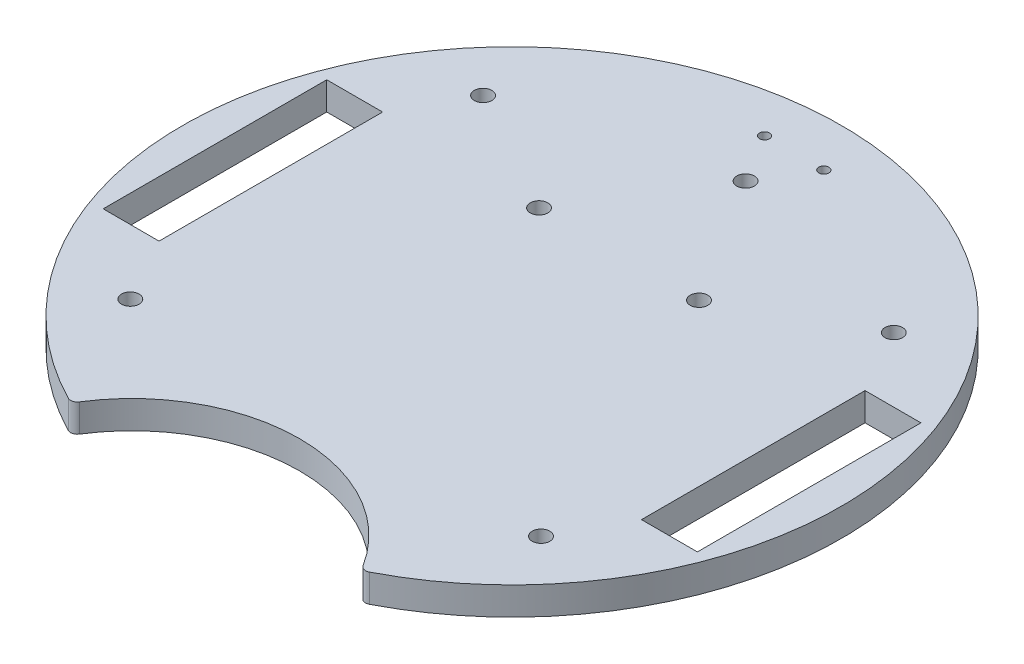
ISO-10303-21;
HEADER;
FILE_DESCRIPTION(('STEP AP214'),'2;1');
FILE_NAME('part.step','',(''),(''),'','','');
FILE_SCHEMA(('AUTOMOTIVE_DESIGN { 1 0 10303 214 1 1 1 1 }'));
ENDSEC;
DATA;
#1=APPLICATION_CONTEXT('core data for automotive mechanical design processes');
#2=APPLICATION_PROTOCOL_DEFINITION('international standard','automotive_design',2000,#1);
#3=PRODUCT_CONTEXT('',#1,'mechanical');
#4=PRODUCT('Part','Part','',(#3));
#5=PRODUCT_RELATED_PRODUCT_CATEGORY('part','',(#4));
#6=PRODUCT_DEFINITION_FORMATION('','',#4);
#7=PRODUCT_DEFINITION_CONTEXT('part definition',#1,'design');
#8=PRODUCT_DEFINITION('design','',#6,#7);
#9=PRODUCT_DEFINITION_SHAPE('','',#8);
#10=(LENGTH_UNIT() NAMED_UNIT(*) SI_UNIT(.MILLI.,.METRE.));
#11=(NAMED_UNIT(*) PLANE_ANGLE_UNIT() SI_UNIT($,.RADIAN.));
#12=(NAMED_UNIT(*) SI_UNIT($,.STERADIAN.) SOLID_ANGLE_UNIT());
#13=UNCERTAINTY_MEASURE_WITH_UNIT(LENGTH_MEASURE(1.E-05),#10,'distance_accuracy_value','');
#14=(GEOMETRIC_REPRESENTATION_CONTEXT(3) GLOBAL_UNCERTAINTY_ASSIGNED_CONTEXT((#13)) GLOBAL_UNIT_ASSIGNED_CONTEXT((#10,
#11,#12)) REPRESENTATION_CONTEXT('',''));
#15=CARTESIAN_POINT('',(0.,0.,0.));
#16=DIRECTION('',(0.,0.,1.));
#17=DIRECTION('',(1.,0.,0.));
#18=AXIS2_PLACEMENT_3D('',#15,#16,#17);
#19=CARTESIAN_POINT('',(33.5100001196225,6.35,65.3012960955778));
#20=DIRECTION('',(0.,-1.,0.));
#21=DIRECTION('',(0.,0.,-1.));
#22=AXIS2_PLACEMENT_3D('',#19,#20,#21);
#23=CYLINDRICAL_SURFACE('',#22,1.50000000000011);
#24=CARTESIAN_POINT('',(33.5100001196225,0.,65.3012960955778));
#25=DIRECTION('',(0.,1.,0.));
#26=DIRECTION('',(0.,0.,1.));
#27=AXIS2_PLACEMENT_3D('',#24,#25,#26);
#28=CIRCLE('',#27,1.50000000000011);
#29=CARTESIAN_POINT('',(34.1948335778492,0.,66.6358383895849));
#30=VERTEX_POINT('',#29);
#31=CARTESIAN_POINT('',(32.2406819332729,0.,66.100565350462));
#32=VERTEX_POINT('',#31);
#33=EDGE_CURVE('E220',#30,#32,#28,.F.);
#34=ORIENTED_EDGE('',*,*,#33,.F.);
#35=DIRECTION('',(0.,-1.,0.));
#36=VECTOR('',#35,1.);
#37=CARTESIAN_POINT('',(34.1948335778492,6.35,66.6358383895849));
#38=LINE('',#37,#36);
#39=CARTESIAN_POINT('',(34.1948335778492,6.35,66.6358383895849));
#40=VERTEX_POINT('',#39);
#41=EDGE_CURVE('E11',#40,#30,#38,.T.);
#42=ORIENTED_EDGE('',*,*,#41,.F.);
#43=CARTESIAN_POINT('',(33.5100001196225,6.35,65.3012960955778));
#44=DIRECTION('',(0.,1.,0.));
#45=DIRECTION('',(0.,0.,1.));
#46=AXIS2_PLACEMENT_3D('',#43,#44,#45);
#47=CIRCLE('',#46,1.50000000000011);
#48=CARTESIAN_POINT('',(32.2406819332729,6.35,66.100565350462));
#49=VERTEX_POINT('',#48);
#50=EDGE_CURVE('E145',#40,#49,#47,.F.);
#51=ORIENTED_EDGE('',*,*,#50,.T.);
#52=DIRECTION('',(0.,-1.,0.));
#53=VECTOR('',#52,1.);
#54=CARTESIAN_POINT('',(32.2406819332729,6.35,66.100565350462));
#55=LINE('',#54,#53);
#56=EDGE_CURVE('E53',#49,#32,#55,.T.);
#57=ORIENTED_EDGE('',*,*,#56,.T.);
#58=EDGE_LOOP('',(#34,#42,#51,#57));
#59=FACE_BOUND('',#58,.T.);
#60=ADVANCED_FACE('F34',(#59),#23,.T.);
#61=CARTESIAN_POINT('',(0.,6.35,0.));
#62=DIRECTION('',(0.,-1.,0.));
#63=DIRECTION('',(0.,0.,-1.));
#64=AXIS2_PLACEMENT_3D('',#61,#62,#63);
#65=CYLINDRICAL_SURFACE('',#64,74.8974071734108);
#66=CARTESIAN_POINT('',(0.,0.,0.));
#67=DIRECTION('',(0.,1.,0.));
#68=DIRECTION('',(0.,0.,1.));
#69=AXIS2_PLACEMENT_3D('',#66,#67,#68);
#70=CIRCLE('',#69,74.8974071734108);
#71=CARTESIAN_POINT('',(-34.1948335778492,0.,66.6358383895849));
#72=VERTEX_POINT('',#71);
#73=EDGE_CURVE('E150',#30,#72,#70,.T.);
#74=ORIENTED_EDGE('',*,*,#73,.T.);
#75=DIRECTION('',(0.,-1.,0.));
#76=VECTOR('',#75,1.);
#77=CARTESIAN_POINT('',(-34.1948335778492,6.35,66.6358383895849));
#78=LINE('',#77,#76);
#79=CARTESIAN_POINT('',(-34.1948335778492,6.35,66.6358383895849));
#80=VERTEX_POINT('',#79);
#81=EDGE_CURVE('E44',#80,#72,#78,.T.);
#82=ORIENTED_EDGE('',*,*,#81,.F.);
#83=CARTESIAN_POINT('',(0.,6.35,0.));
#84=DIRECTION('',(0.,1.,0.));
#85=DIRECTION('',(0.,0.,1.));
#86=AXIS2_PLACEMENT_3D('',#83,#84,#85);
#87=CIRCLE('',#86,74.8974071734108);
#88=EDGE_CURVE('E139',#40,#80,#87,.T.);
#89=ORIENTED_EDGE('',*,*,#88,.F.);
#90=ORIENTED_EDGE('',*,*,#41,.T.);
#91=EDGE_LOOP('',(#74,#82,#89,#90));
#92=FACE_BOUND('',#91,.T.);
#93=ADVANCED_FACE('F148',(#92),#65,.T.);
#94=CARTESIAN_POINT('',(-33.5100001196225,6.35,65.3012960955779));
#95=DIRECTION('',(0.,-1.,0.));
#96=DIRECTION('',(0.,0.,-1.));
#97=AXIS2_PLACEMENT_3D('',#94,#95,#96);
#98=CYLINDRICAL_SURFACE('',#97,1.50000000000026);
#99=CARTESIAN_POINT('',(-33.5100001196225,0.,65.3012960955779));
#100=DIRECTION('',(0.,1.,0.));
#101=DIRECTION('',(0.,0.,1.));
#102=AXIS2_PLACEMENT_3D('',#99,#100,#101);
#103=CIRCLE('',#102,1.50000000000026);
#104=CARTESIAN_POINT('',(-32.2406819332729,0.,66.100565350462));
#105=VERTEX_POINT('',#104);
#106=EDGE_CURVE('E223',#72,#105,#103,.T.);
#107=ORIENTED_EDGE('',*,*,#106,.T.);
#108=DIRECTION('',(0.,-1.,0.));
#109=VECTOR('',#108,1.);
#110=CARTESIAN_POINT('',(-32.2406819332729,6.35,66.100565350462));
#111=LINE('',#110,#109);
#112=CARTESIAN_POINT('',(-32.2406819332729,6.35,66.100565350462));
#113=VERTEX_POINT('',#112);
#114=EDGE_CURVE('E91',#113,#105,#111,.T.);
#115=ORIENTED_EDGE('',*,*,#114,.F.);
#116=CARTESIAN_POINT('',(-33.5100001196225,6.35,65.3012960955779));
#117=DIRECTION('',(0.,1.,0.));
#118=DIRECTION('',(0.,0.,1.));
#119=AXIS2_PLACEMENT_3D('',#116,#117,#118);
#120=CIRCLE('',#119,1.50000000000026);
#121=EDGE_CURVE('E131',#80,#113,#120,.T.);
#122=ORIENTED_EDGE('',*,*,#121,.F.);
#123=ORIENTED_EDGE('',*,*,#81,.T.);
#124=EDGE_LOOP('',(#107,#115,#122,#123));
#125=FACE_BOUND('',#124,.T.);
#126=ADVANCED_FACE('F133',(#125),#98,.T.);
#127=CARTESIAN_POINT('',(67.5141237268841,6.35,0.));
#128=DIRECTION('',(-1.,0.,0.));
#129=DIRECTION('',(0.,0.,1.));
#130=AXIS2_PLACEMENT_3D('',#127,#128,#129);
#131=PLANE('',#130);
#132=DIRECTION('',(0.,0.,-1.));
#133=VECTOR('',#132,1.);
#134=CARTESIAN_POINT('',(67.5141237268841,0.,0.));
#135=LINE('',#134,#133);
#136=CARTESIAN_POINT('',(67.5141237268841,0.,25.3999999999999));
#137=VERTEX_POINT('',#136);
#138=CARTESIAN_POINT('',(67.5141237268841,0.,-25.4000000000001));
#139=VERTEX_POINT('',#138);
#140=EDGE_CURVE('E199',#137,#139,#135,.T.);
#141=ORIENTED_EDGE('',*,*,#140,.F.);
#142=DIRECTION('',(0.,-1.,0.));
#143=VECTOR('',#142,1.);
#144=CARTESIAN_POINT('',(67.5141237268841,6.35,25.3999999999999));
#145=LINE('',#144,#143);
#146=CARTESIAN_POINT('',(67.5141237268841,6.35,25.3999999999999));
#147=VERTEX_POINT('',#146);
#148=EDGE_CURVE('E162',#147,#137,#145,.T.);
#149=ORIENTED_EDGE('',*,*,#148,.F.);
#150=DIRECTION('',(0.,0.,-1.));
#151=VECTOR('',#150,1.);
#152=CARTESIAN_POINT('',(67.5141237268841,6.35,0.));
#153=LINE('',#152,#151);
#154=CARTESIAN_POINT('',(67.5141237268841,6.35,-25.4000000000001));
#155=VERTEX_POINT('',#154);
#156=EDGE_CURVE('E257',#147,#155,#153,.T.);
#157=ORIENTED_EDGE('',*,*,#156,.T.);
#158=DIRECTION('',(0.,-1.,0.));
#159=VECTOR('',#158,1.);
#160=CARTESIAN_POINT('',(67.5141237268841,6.35,-25.4000000000001));
#161=LINE('',#160,#159);
#162=EDGE_CURVE('E155',#155,#139,#161,.T.);
#163=ORIENTED_EDGE('',*,*,#162,.T.);
#164=EDGE_LOOP('',(#141,#149,#157,#163));
#165=FACE_BOUND('',#164,.T.);
#166=ADVANCED_FACE('F360',(#165),#131,.T.);
#167=CARTESIAN_POINT('',(0.,6.35,25.3999999999999));
#168=DIRECTION('',(0.,0.,1.));
#169=DIRECTION('',(1.,0.,0.));
#170=AXIS2_PLACEMENT_3D('',#167,#168,#169);
#171=PLANE('',#170);
#172=DIRECTION('',(-1.,0.,0.));
#173=VECTOR('',#172,1.);
#174=CARTESIAN_POINT('',(0.,0.,25.3999999999999));
#175=LINE('',#174,#173);
#176=CARTESIAN_POINT('',(54.8141237268841,0.,25.3999999999999));
#177=VERTEX_POINT('',#176);
#178=EDGE_CURVE('E202',#137,#177,#175,.T.);
#179=ORIENTED_EDGE('',*,*,#178,.T.);
#180=DIRECTION('',(0.,-1.,0.));
#181=VECTOR('',#180,1.);
#182=CARTESIAN_POINT('',(54.8141237268841,6.35,25.3999999999999));
#183=LINE('',#182,#181);
#184=CARTESIAN_POINT('',(54.8141237268841,6.35,25.3999999999999));
#185=VERTEX_POINT('',#184);
#186=EDGE_CURVE('E159',#185,#177,#183,.T.);
#187=ORIENTED_EDGE('',*,*,#186,.F.);
#188=DIRECTION('',(-1.,0.,0.));
#189=VECTOR('',#188,1.);
#190=CARTESIAN_POINT('',(0.,6.35,25.3999999999999));
#191=LINE('',#190,#189);
#192=EDGE_CURVE('E260',#147,#185,#191,.T.);
#193=ORIENTED_EDGE('',*,*,#192,.F.);
#194=ORIENTED_EDGE('',*,*,#148,.T.);
#195=EDGE_LOOP('',(#179,#187,#193,#194));
#196=FACE_BOUND('',#195,.T.);
#197=ADVANCED_FACE('F356',(#196),#171,.F.);
#198=CARTESIAN_POINT('',(54.8141237268841,6.35,0.));
#199=DIRECTION('',(-1.,0.,0.));
#200=DIRECTION('',(0.,0.,1.));
#201=AXIS2_PLACEMENT_3D('',#198,#199,#200);
#202=PLANE('',#201);
#203=DIRECTION('',(0.,0.,-1.));
#204=VECTOR('',#203,1.);
#205=CARTESIAN_POINT('',(54.8141237268841,0.,0.));
#206=LINE('',#205,#204);
#207=CARTESIAN_POINT('',(54.8141237268841,0.,-25.4000000000001));
#208=VERTEX_POINT('',#207);
#209=EDGE_CURVE('E205',#177,#208,#206,.T.);
#210=ORIENTED_EDGE('',*,*,#209,.T.);
#211=DIRECTION('',(0.,-1.,0.));
#212=VECTOR('',#211,1.);
#213=CARTESIAN_POINT('',(54.8141237268841,6.35,-25.4000000000001));
#214=LINE('',#213,#212);
#215=CARTESIAN_POINT('',(54.8141237268841,6.35,-25.4000000000001));
#216=VERTEX_POINT('',#215);
#217=EDGE_CURVE('E157',#216,#208,#214,.T.);
#218=ORIENTED_EDGE('',*,*,#217,.F.);
#219=DIRECTION('',(0.,0.,-1.));
#220=VECTOR('',#219,1.);
#221=CARTESIAN_POINT('',(54.8141237268841,6.35,0.));
#222=LINE('',#221,#220);
#223=EDGE_CURVE('E263',#185,#216,#222,.T.);
#224=ORIENTED_EDGE('',*,*,#223,.F.);
#225=ORIENTED_EDGE('',*,*,#186,.T.);
#226=EDGE_LOOP('',(#210,#218,#224,#225));
#227=FACE_BOUND('',#226,.T.);
#228=ADVANCED_FACE('F353',(#227),#202,.F.);
#229=CARTESIAN_POINT('',(0.,6.35,-25.4000000000001));
#230=DIRECTION('',(0.,0.,-1.));
#231=DIRECTION('',(-1.,0.,0.));
#232=AXIS2_PLACEMENT_3D('',#229,#230,#231);
#233=PLANE('',#232);
#234=DIRECTION('',(1.,0.,0.));
#235=VECTOR('',#234,1.);
#236=CARTESIAN_POINT('',(0.,0.,-25.4000000000001));
#237=LINE('',#236,#235);
#238=CARTESIAN_POINT('',(-67.5141237268841,0.,-25.4000000000001));
#239=VERTEX_POINT('',#238);
#240=CARTESIAN_POINT('',(-54.8141237268841,0.,-25.4000000000001));
#241=VERTEX_POINT('',#240);
#242=EDGE_CURVE('E182',#239,#241,#237,.T.);
#243=ORIENTED_EDGE('',*,*,#242,.T.);
#244=DIRECTION('',(0.,-1.,0.));
#245=VECTOR('',#244,1.);
#246=CARTESIAN_POINT('',(-54.8141237268841,6.35,-25.4000000000001));
#247=LINE('',#246,#245);
#248=CARTESIAN_POINT('',(-54.8141237268841,6.35,-25.4000000000001));
#249=VERTEX_POINT('',#248);
#250=EDGE_CURVE('E38',#249,#241,#247,.T.);
#251=ORIENTED_EDGE('',*,*,#250,.F.);
#252=DIRECTION('',(1.,0.,0.));
#253=VECTOR('',#252,1.);
#254=CARTESIAN_POINT('',(0.,6.35,-25.4000000000001));
#255=LINE('',#254,#253);
#256=CARTESIAN_POINT('',(-67.5141237268841,6.35,-25.4000000000001));
#257=VERTEX_POINT('',#256);
#258=EDGE_CURVE('E250',#257,#249,#255,.T.);
#259=ORIENTED_EDGE('',*,*,#258,.F.);
#260=DIRECTION('',(0.,-1.,0.));
#261=VECTOR('',#260,1.);
#262=CARTESIAN_POINT('',(-67.5141237268841,6.35,-25.4000000000001));
#263=LINE('',#262,#261);
#264=EDGE_CURVE('E164',#257,#239,#263,.T.);
#265=ORIENTED_EDGE('',*,*,#264,.T.);
#266=EDGE_LOOP('',(#243,#251,#259,#265));
#267=FACE_BOUND('',#266,.T.);
#268=ADVANCED_FACE('F183',(#267),#233,.F.);
#269=CARTESIAN_POINT('',(-54.8141237268841,6.35,0.));
#270=DIRECTION('',(1.,0.,0.));
#271=DIRECTION('',(0.,0.,-1.));
#272=AXIS2_PLACEMENT_3D('',#269,#270,#271);
#273=PLANE('',#272);
#274=DIRECTION('',(0.,0.,1.));
#275=VECTOR('',#274,1.);
#276=CARTESIAN_POINT('',(-54.8141237268841,0.,0.));
#277=LINE('',#276,#275);
#278=CARTESIAN_POINT('',(-54.8141237268841,0.,25.3999999999999));
#279=VERTEX_POINT('',#278);
#280=EDGE_CURVE('E177',#241,#279,#277,.T.);
#281=ORIENTED_EDGE('',*,*,#280,.T.);
#282=DIRECTION('',(0.,-1.,0.));
#283=VECTOR('',#282,1.);
#284=CARTESIAN_POINT('',(-54.8141237268841,6.35,25.3999999999999));
#285=LINE('',#284,#283);
#286=CARTESIAN_POINT('',(-54.8141237268841,6.35,25.3999999999999));
#287=VERTEX_POINT('',#286);
#288=EDGE_CURVE('E169',#287,#279,#285,.T.);
#289=ORIENTED_EDGE('',*,*,#288,.F.);
#290=DIRECTION('',(0.,0.,1.));
#291=VECTOR('',#290,1.);
#292=CARTESIAN_POINT('',(-54.8141237268841,6.35,0.));
#293=LINE('',#292,#291);
#294=EDGE_CURVE('E104',#249,#287,#293,.T.);
#295=ORIENTED_EDGE('',*,*,#294,.F.);
#296=ORIENTED_EDGE('',*,*,#250,.T.);
#297=EDGE_LOOP('',(#281,#289,#295,#296));
#298=FACE_BOUND('',#297,.T.);
#299=ADVANCED_FACE('F176',(#298),#273,.F.);
#300=CARTESIAN_POINT('',(0.,6.35,25.3999999999999));
#301=DIRECTION('',(0.,0.,-1.));
#302=DIRECTION('',(-1.,0.,0.));
#303=AXIS2_PLACEMENT_3D('',#300,#301,#302);
#304=PLANE('',#303);
#305=DIRECTION('',(1.,0.,0.));
#306=VECTOR('',#305,1.);
#307=CARTESIAN_POINT('',(0.,0.,25.3999999999999));
#308=LINE('',#307,#306);
#309=CARTESIAN_POINT('',(-67.5141237268841,0.,25.3999999999999));
#310=VERTEX_POINT('',#309);
#311=EDGE_CURVE('E189',#310,#279,#308,.T.);
#312=ORIENTED_EDGE('',*,*,#311,.F.);
#313=DIRECTION('',(0.,-1.,0.));
#314=VECTOR('',#313,1.);
#315=CARTESIAN_POINT('',(-67.5141237268841,6.35,25.3999999999999));
#316=LINE('',#315,#314);
#317=CARTESIAN_POINT('',(-67.5141237268841,6.35,25.3999999999999));
#318=VERTEX_POINT('',#317);
#319=EDGE_CURVE('E167',#318,#310,#316,.T.);
#320=ORIENTED_EDGE('',*,*,#319,.F.);
#321=DIRECTION('',(1.,0.,0.));
#322=VECTOR('',#321,1.);
#323=CARTESIAN_POINT('',(0.,6.35,25.3999999999999));
#324=LINE('',#323,#322);
#325=EDGE_CURVE('E253',#318,#287,#324,.T.);
#326=ORIENTED_EDGE('',*,*,#325,.T.);
#327=ORIENTED_EDGE('',*,*,#288,.T.);
#328=EDGE_LOOP('',(#312,#320,#326,#327));
#329=FACE_BOUND('',#328,.T.);
#330=ADVANCED_FACE('F318',(#329),#304,.T.);
#331=CARTESIAN_POINT('',(-6.731,6.35,-64.1076988434385));
#332=DIRECTION('',(0.,-1.,0.));
#333=DIRECTION('',(0.,0.,-1.));
#334=AXIS2_PLACEMENT_3D('',#331,#332,#333);
#335=CYLINDRICAL_SURFACE('',#334,1.143);
#336=CARTESIAN_POINT('',(-6.731,6.35,-64.1076988434385));
#337=DIRECTION('',(0.,1.,0.));
#338=DIRECTION('',(0.,0.,1.));
#339=AXIS2_PLACEMENT_3D('',#336,#337,#338);
#340=CIRCLE('',#339,1.143);
#341=CARTESIAN_POINT('',(-6.731,6.35,-62.9646988434385));
#342=VERTEX_POINT('',#341);
#343=EDGE_CURVE('E279',#342,#342,#340,.T.);
#344=ORIENTED_EDGE('',*,*,#343,.T.);
#345=EDGE_LOOP('',(#344));
#346=FACE_BOUND('',#345,.T.);
#347=CARTESIAN_POINT('',(-6.731,0.,-64.1076988434385));
#348=DIRECTION('',(0.,1.,0.));
#349=DIRECTION('',(0.,0.,1.));
#350=AXIS2_PLACEMENT_3D('',#347,#348,#349);
#351=CIRCLE('',#350,1.143);
#352=CARTESIAN_POINT('',(-6.731,0.,-62.9646988434385));
#353=VERTEX_POINT('',#352);
#354=EDGE_CURVE('E228',#353,#353,#351,.T.);
#355=ORIENTED_EDGE('',*,*,#354,.F.);
#356=EDGE_LOOP('',(#355));
#357=FACE_BOUND('',#356,.T.);
#358=ADVANCED_FACE('F315',(#346,#357),#335,.F.);
#359=CARTESIAN_POINT('',(0.,6.35,86.4020044245157));
#360=DIRECTION('',(0.,-1.,0.));
#361=DIRECTION('',(0.,0.,-1.));
#362=AXIS2_PLACEMENT_3D('',#359,#360,#361);
#363=CYLINDRICAL_SURFACE('',#362,38.0999999999998);
#364=CARTESIAN_POINT('',(0.,0.,86.4020044245157));
#365=DIRECTION('',(0.,1.,0.));
#366=DIRECTION('',(0.,0.,1.));
#367=AXIS2_PLACEMENT_3D('',#364,#365,#366);
#368=CIRCLE('',#367,38.0999999999998);
#369=EDGE_CURVE('E225',#32,#105,#368,.T.);
#370=ORIENTED_EDGE('',*,*,#369,.F.);
#371=ORIENTED_EDGE('',*,*,#56,.F.);
#372=CARTESIAN_POINT('',(0.,6.35,86.4020044245157));
#373=DIRECTION('',(0.,1.,0.));
#374=DIRECTION('',(0.,0.,1.));
#375=AXIS2_PLACEMENT_3D('',#372,#373,#374);
#376=CIRCLE('',#375,38.0999999999998);
#377=EDGE_CURVE('E138',#49,#113,#376,.T.);
#378=ORIENTED_EDGE('',*,*,#377,.T.);
#379=ORIENTED_EDGE('',*,*,#114,.T.);
#380=EDGE_LOOP('',(#370,#371,#378,#379));
#381=FACE_BOUND('',#380,.T.);
#382=ADVANCED_FACE('F317',(#381),#363,.F.);
#383=CARTESIAN_POINT('',(46.6637339832601,6.35,-40.0812318826666));
#384=DIRECTION('',(0.,-1.,0.));
#385=DIRECTION('',(0.,0.,-1.));
#386=AXIS2_PLACEMENT_3D('',#383,#384,#385);
#387=CYLINDRICAL_SURFACE('',#386,2.);
#388=CARTESIAN_POINT('',(46.6637339832601,6.35,-40.0812318826666));
#389=DIRECTION('',(0.,1.,0.));
#390=DIRECTION('',(0.,0.,1.));
#391=AXIS2_PLACEMENT_3D('',#388,#389,#390);
#392=CIRCLE('',#391,2.);
#393=CARTESIAN_POINT('',(46.6637339832601,6.35,-38.0812318826666));
#394=VERTEX_POINT('',#393);
#395=EDGE_CURVE('E274',#394,#394,#392,.F.);
#396=ORIENTED_EDGE('',*,*,#395,.F.);
#397=EDGE_LOOP('',(#396));
#398=FACE_BOUND('',#397,.T.);
#399=CARTESIAN_POINT('',(46.6637339832601,0.,-40.0812318826666));
#400=DIRECTION('',(0.,1.,0.));
#401=DIRECTION('',(0.,0.,1.));
#402=AXIS2_PLACEMENT_3D('',#399,#400,#401);
#403=CIRCLE('',#402,2.);
#404=CARTESIAN_POINT('',(46.6637339832601,0.,-38.0812318826666));
#405=VERTEX_POINT('',#404);
#406=EDGE_CURVE('E217',#405,#405,#403,.F.);
#407=ORIENTED_EDGE('',*,*,#406,.T.);
#408=EDGE_LOOP('',(#407));
#409=FACE_BOUND('',#408,.T.);
#410=ADVANCED_FACE('F325',(#398,#409),#387,.F.);
#411=CARTESIAN_POINT('',(46.6637339832601,6.35,40.0812318826666));
#412=DIRECTION('',(0.,-1.,0.));
#413=DIRECTION('',(0.,0.,-1.));
#414=AXIS2_PLACEMENT_3D('',#411,#412,#413);
#415=CYLINDRICAL_SURFACE('',#414,2.);
#416=CARTESIAN_POINT('',(46.6637339832601,6.35,40.0812318826666));
#417=DIRECTION('',(0.,1.,0.));
#418=DIRECTION('',(0.,0.,1.));
#419=AXIS2_PLACEMENT_3D('',#416,#417,#418);
#420=CIRCLE('',#419,2.);
#421=CARTESIAN_POINT('',(46.6637339832601,6.35,42.0812318826666));
#422=VERTEX_POINT('',#421);
#423=EDGE_CURVE('E271',#422,#422,#420,.T.);
#424=ORIENTED_EDGE('',*,*,#423,.T.);
#425=EDGE_LOOP('',(#424));
#426=FACE_BOUND('',#425,.T.);
#427=CARTESIAN_POINT('',(46.6637339832601,0.,40.0812318826666));
#428=DIRECTION('',(0.,1.,0.));
#429=DIRECTION('',(0.,0.,1.));
#430=AXIS2_PLACEMENT_3D('',#427,#428,#429);
#431=CIRCLE('',#430,2.);
#432=CARTESIAN_POINT('',(46.6637339832601,0.,42.0812318826666));
#433=VERTEX_POINT('',#432);
#434=EDGE_CURVE('E214',#433,#433,#431,.T.);
#435=ORIENTED_EDGE('',*,*,#434,.F.);
#436=EDGE_LOOP('',(#435));
#437=FACE_BOUND('',#436,.T.);
#438=ADVANCED_FACE('F339',(#426,#437),#415,.F.);
#439=CARTESIAN_POINT('',(-46.6637339832601,6.35,40.0812318826666));
#440=DIRECTION('',(0.,-1.,0.));
#441=DIRECTION('',(0.,0.,-1.));
#442=AXIS2_PLACEMENT_3D('',#439,#440,#441);
#443=CYLINDRICAL_SURFACE('',#442,2.);
#444=CARTESIAN_POINT('',(-46.6637339832601,6.35,40.0812318826666));
#445=DIRECTION('',(0.,1.,0.));
#446=DIRECTION('',(0.,0.,1.));
#447=AXIS2_PLACEMENT_3D('',#444,#445,#446);
#448=CIRCLE('',#447,2.);
#449=CARTESIAN_POINT('',(-46.6637339832601,6.35,42.0812318826666));
#450=VERTEX_POINT('',#449);
#451=EDGE_CURVE('E268',#450,#450,#448,.T.);
#452=ORIENTED_EDGE('',*,*,#451,.T.);
#453=EDGE_LOOP('',(#452));
#454=FACE_BOUND('',#453,.T.);
#455=CARTESIAN_POINT('',(-46.6637339832601,0.,40.0812318826666));
#456=DIRECTION('',(0.,1.,0.));
#457=DIRECTION('',(0.,0.,1.));
#458=AXIS2_PLACEMENT_3D('',#455,#456,#457);
#459=CIRCLE('',#458,2.);
#460=CARTESIAN_POINT('',(-46.6637339832601,0.,42.0812318826666));
#461=VERTEX_POINT('',#460);
#462=EDGE_CURVE('E211',#461,#461,#459,.T.);
#463=ORIENTED_EDGE('',*,*,#462,.F.);
#464=EDGE_LOOP('',(#463));
#465=FACE_BOUND('',#464,.T.);
#466=ADVANCED_FACE('F343',(#454,#465),#443,.F.);
#467=CARTESIAN_POINT('',(0.,6.35,-25.4000000000001));
#468=DIRECTION('',(0.,0.,1.));
#469=DIRECTION('',(1.,0.,0.));
#470=AXIS2_PLACEMENT_3D('',#467,#468,#469);
#471=PLANE('',#470);
#472=DIRECTION('',(-1.,0.,0.));
#473=VECTOR('',#472,1.);
#474=CARTESIAN_POINT('',(0.,0.,-25.4000000000001));
#475=LINE('',#474,#473);
#476=EDGE_CURVE('E208',#139,#208,#475,.T.);
#477=ORIENTED_EDGE('',*,*,#476,.F.);
#478=ORIENTED_EDGE('',*,*,#162,.F.);
#479=DIRECTION('',(-1.,0.,0.));
#480=VECTOR('',#479,1.);
#481=CARTESIAN_POINT('',(0.,6.35,-25.4000000000001));
#482=LINE('',#481,#480);
#483=EDGE_CURVE('E265',#155,#216,#482,.T.);
#484=ORIENTED_EDGE('',*,*,#483,.T.);
#485=ORIENTED_EDGE('',*,*,#217,.T.);
#486=EDGE_LOOP('',(#477,#478,#484,#485));
#487=FACE_BOUND('',#486,.T.);
#488=ADVANCED_FACE('F347',(#487),#471,.T.);
#489=CARTESIAN_POINT('',(-67.5141237268841,6.35,0.));
#490=DIRECTION('',(-1.,0.,0.));
#491=DIRECTION('',(0.,0.,1.));
#492=AXIS2_PLACEMENT_3D('',#489,#490,#491);
#493=PLANE('',#492);
#494=DIRECTION('',(0.,0.,-1.));
#495=VECTOR('',#494,1.);
#496=CARTESIAN_POINT('',(-67.5141237268841,0.,0.));
#497=LINE('',#496,#495);
#498=EDGE_CURVE('E197',#310,#239,#497,.T.);
#499=ORIENTED_EDGE('',*,*,#498,.T.);
#500=ORIENTED_EDGE('',*,*,#264,.F.);
#501=DIRECTION('',(0.,0.,-1.));
#502=VECTOR('',#501,1.);
#503=CARTESIAN_POINT('',(-67.5141237268841,6.35,0.));
#504=LINE('',#503,#502);
#505=EDGE_CURVE('E255',#318,#257,#504,.T.);
#506=ORIENTED_EDGE('',*,*,#505,.F.);
#507=ORIENTED_EDGE('',*,*,#319,.T.);
#508=EDGE_LOOP('',(#499,#500,#506,#507));
#509=FACE_BOUND('',#508,.T.);
#510=ADVANCED_FACE('F351',(#509),#493,.F.);
#511=CARTESIAN_POINT('',(-18.1789527954067,6.35,-24.3105510962522));
#512=DIRECTION('',(0.,-1.,0.));
#513=DIRECTION('',(0.,0.,-1.));
#514=AXIS2_PLACEMENT_3D('',#511,#512,#513);
#515=CYLINDRICAL_SURFACE('',#514,2.);
#516=CARTESIAN_POINT('',(-18.1789527954067,6.35,-24.3105510962522));
#517=DIRECTION('',(0.,1.,0.));
#518=DIRECTION('',(0.,0.,1.));
#519=AXIS2_PLACEMENT_3D('',#516,#517,#518);
#520=CIRCLE('',#519,2.);
#521=CARTESIAN_POINT('',(-18.1789527954067,6.35,-22.3105510962522));
#522=VERTEX_POINT('',#521);
#523=EDGE_CURVE('E247',#522,#522,#520,.F.);
#524=ORIENTED_EDGE('',*,*,#523,.F.);
#525=EDGE_LOOP('',(#524));
#526=FACE_BOUND('',#525,.T.);
#527=CARTESIAN_POINT('',(-18.1789527954067,0.,-24.3105510962522));
#528=DIRECTION('',(0.,1.,0.));
#529=DIRECTION('',(0.,0.,1.));
#530=AXIS2_PLACEMENT_3D('',#527,#528,#529);
#531=CIRCLE('',#530,2.);
#532=CARTESIAN_POINT('',(-18.1789527954067,0.,-22.3105510962522));
#533=VERTEX_POINT('',#532);
#534=EDGE_CURVE('E187',#533,#533,#531,.F.);
#535=ORIENTED_EDGE('',*,*,#534,.T.);
#536=EDGE_LOOP('',(#535));
#537=FACE_BOUND('',#536,.T.);
#538=ADVANCED_FACE('F366',(#526,#537),#515,.F.);
#539=CARTESIAN_POINT('',(-46.6637339832601,6.35,-40.0812318826666));
#540=DIRECTION('',(0.,-1.,0.));
#541=DIRECTION('',(0.,0.,-1.));
#542=AXIS2_PLACEMENT_3D('',#539,#540,#541);
#543=CYLINDRICAL_SURFACE('',#542,2.);
#544=CARTESIAN_POINT('',(-46.6637339832601,6.35,-40.0812318826666));
#545=DIRECTION('',(0.,1.,0.));
#546=DIRECTION('',(0.,0.,1.));
#547=AXIS2_PLACEMENT_3D('',#544,#545,#546);
#548=CIRCLE('',#547,2.);
#549=CARTESIAN_POINT('',(-46.6637339832601,6.35,-38.0812318826666));
#550=VERTEX_POINT('',#549);
#551=EDGE_CURVE('E242',#550,#550,#548,.F.);
#552=ORIENTED_EDGE('',*,*,#551,.F.);
#553=EDGE_LOOP('',(#552));
#554=FACE_BOUND('',#553,.T.);
#555=CARTESIAN_POINT('',(-46.6637339832601,0.,-40.0812318826666));
#556=DIRECTION('',(0.,1.,0.));
#557=DIRECTION('',(0.,0.,1.));
#558=AXIS2_PLACEMENT_3D('',#555,#556,#557);
#559=CIRCLE('',#558,2.);
#560=CARTESIAN_POINT('',(-46.6637339832601,0.,-38.0812318826666));
#561=VERTEX_POINT('',#560);
#562=EDGE_CURVE('E192',#561,#561,#559,.F.);
#563=ORIENTED_EDGE('',*,*,#562,.T.);
#564=EDGE_LOOP('',(#563));
#565=FACE_BOUND('',#564,.T.);
#566=ADVANCED_FACE('F292',(#554,#565),#543,.F.);
#567=CARTESIAN_POINT('',(18.1789527954067,6.35,-24.3105510962522));
#568=DIRECTION('',(0.,-1.,0.));
#569=DIRECTION('',(0.,0.,-1.));
#570=AXIS2_PLACEMENT_3D('',#567,#568,#569);
#571=CYLINDRICAL_SURFACE('',#570,2.);
#572=CARTESIAN_POINT('',(18.1789527954067,6.35,-24.3105510962522));
#573=DIRECTION('',(0.,1.,0.));
#574=DIRECTION('',(0.,0.,1.));
#575=AXIS2_PLACEMENT_3D('',#572,#573,#574);
#576=CIRCLE('',#575,2.);
#577=CARTESIAN_POINT('',(18.1789527954067,6.35,-22.3105510962522));
#578=VERTEX_POINT('',#577);
#579=EDGE_CURVE('E237',#578,#578,#576,.T.);
#580=ORIENTED_EDGE('',*,*,#579,.T.);
#581=EDGE_LOOP('',(#580));
#582=FACE_BOUND('',#581,.T.);
#583=CARTESIAN_POINT('',(18.1789527954067,0.,-24.3105510962522));
#584=DIRECTION('',(0.,1.,0.));
#585=DIRECTION('',(0.,0.,1.));
#586=AXIS2_PLACEMENT_3D('',#583,#584,#585);
#587=CIRCLE('',#586,2.);
#588=CARTESIAN_POINT('',(18.1789527954067,0.,-22.3105510962522));
#589=VERTEX_POINT('',#588);
#590=EDGE_CURVE('E287',#589,#589,#587,.T.);
#591=ORIENTED_EDGE('',*,*,#590,.F.);
#592=EDGE_LOOP('',(#591));
#593=FACE_BOUND('',#592,.T.);
#594=ADVANCED_FACE('F377',(#582,#593),#571,.F.);
#595=CARTESIAN_POINT('',(0.,6.35,-53.0611879648997));
#596=DIRECTION('',(0.,-1.,0.));
#597=DIRECTION('',(0.,0.,-1.));
#598=AXIS2_PLACEMENT_3D('',#595,#596,#597);
#599=CYLINDRICAL_SURFACE('',#598,2.);
#600=CARTESIAN_POINT('',(0.,6.35,-53.0611879648997));
#601=DIRECTION('',(0.,1.,0.));
#602=DIRECTION('',(0.,0.,1.));
#603=AXIS2_PLACEMENT_3D('',#600,#601,#602);
#604=CIRCLE('',#603,2.);
#605=CARTESIAN_POINT('',(0.,6.35,-51.0611879648997));
#606=VERTEX_POINT('',#605);
#607=EDGE_CURVE('E233',#606,#606,#604,.T.);
#608=ORIENTED_EDGE('',*,*,#607,.T.);
#609=EDGE_LOOP('',(#608));
#610=FACE_BOUND('',#609,.T.);
#611=CARTESIAN_POINT('',(0.,0.,-53.0611879648997));
#612=DIRECTION('',(0.,1.,0.));
#613=DIRECTION('',(0.,0.,1.));
#614=AXIS2_PLACEMENT_3D('',#611,#612,#613);
#615=CIRCLE('',#614,2.);
#616=CARTESIAN_POINT('',(0.,0.,-51.0611879648997));
#617=VERTEX_POINT('',#616);
#618=EDGE_CURVE('E284',#617,#617,#615,.T.);
#619=ORIENTED_EDGE('',*,*,#618,.F.);
#620=EDGE_LOOP('',(#619));
#621=FACE_BOUND('',#620,.T.);
#622=ADVANCED_FACE('F36',(#610,#621),#599,.F.);
#623=CARTESIAN_POINT('',(6.731,6.35,-64.1076988434385));
#624=DIRECTION('',(0.,-1.,0.));
#625=DIRECTION('',(0.,0.,-1.));
#626=AXIS2_PLACEMENT_3D('',#623,#624,#625);
#627=CYLINDRICAL_SURFACE('',#626,1.143);
#628=CARTESIAN_POINT('',(6.731,6.35,-64.1076988434385));
#629=DIRECTION('',(0.,1.,0.));
#630=DIRECTION('',(0.,0.,1.));
#631=AXIS2_PLACEMENT_3D('',#628,#629,#630);
#632=CIRCLE('',#631,1.143);
#633=CARTESIAN_POINT('',(6.731,6.35,-62.9646988434385));
#634=VERTEX_POINT('',#633);
#635=EDGE_CURVE('E168',#634,#634,#632,.F.);
#636=ORIENTED_EDGE('',*,*,#635,.F.);
#637=EDGE_LOOP('',(#636));
#638=FACE_BOUND('',#637,.T.);
#639=CARTESIAN_POINT('',(6.731,0.,-64.1076988434385));
#640=DIRECTION('',(0.,1.,0.));
#641=DIRECTION('',(0.,0.,1.));
#642=AXIS2_PLACEMENT_3D('',#639,#640,#641);
#643=CIRCLE('',#642,1.143);
#644=CARTESIAN_POINT('',(6.731,0.,-62.9646988434385));
#645=VERTEX_POINT('',#644);
#646=EDGE_CURVE('E231',#645,#645,#643,.F.);
#647=ORIENTED_EDGE('',*,*,#646,.T.);
#648=EDGE_LOOP('',(#647));
#649=FACE_BOUND('',#648,.T.);
#650=ADVANCED_FACE('F384',(#638,#649),#627,.F.);
#651=CARTESIAN_POINT('',(0.,6.35,0.));
#652=DIRECTION('',(0.,1.,0.));
#653=DIRECTION('',(0.,0.,1.));
#654=AXIS2_PLACEMENT_3D('',#651,#652,#653);
#655=PLANE('',#654);
#656=ORIENTED_EDGE('',*,*,#607,.F.);
#657=EDGE_LOOP('',(#656));
#658=FACE_BOUND('',#657,.T.);
#659=ORIENTED_EDGE('',*,*,#579,.F.);
#660=EDGE_LOOP('',(#659));
#661=FACE_BOUND('',#660,.T.);
#662=ORIENTED_EDGE('',*,*,#551,.T.);
#663=EDGE_LOOP('',(#662));
#664=FACE_BOUND('',#663,.T.);
#665=ORIENTED_EDGE('',*,*,#523,.T.);
#666=EDGE_LOOP('',(#665));
#667=FACE_BOUND('',#666,.T.);
#668=ORIENTED_EDGE('',*,*,#258,.T.);
#669=ORIENTED_EDGE('',*,*,#294,.T.);
#670=ORIENTED_EDGE('',*,*,#325,.F.);
#671=ORIENTED_EDGE('',*,*,#505,.T.);
#672=EDGE_LOOP('',(#668,#669,#670,#671));
#673=FACE_BOUND('',#672,.T.);
#674=ORIENTED_EDGE('',*,*,#156,.F.);
#675=ORIENTED_EDGE('',*,*,#192,.T.);
#676=ORIENTED_EDGE('',*,*,#223,.T.);
#677=ORIENTED_EDGE('',*,*,#483,.F.);
#678=EDGE_LOOP('',(#674,#675,#676,#677));
#679=FACE_BOUND('',#678,.T.);
#680=ORIENTED_EDGE('',*,*,#451,.F.);
#681=EDGE_LOOP('',(#680));
#682=FACE_BOUND('',#681,.T.);
#683=ORIENTED_EDGE('',*,*,#423,.F.);
#684=EDGE_LOOP('',(#683));
#685=FACE_BOUND('',#684,.T.);
#686=ORIENTED_EDGE('',*,*,#395,.T.);
#687=EDGE_LOOP('',(#686));
#688=FACE_BOUND('',#687,.T.);
#689=ORIENTED_EDGE('',*,*,#50,.F.);
#690=ORIENTED_EDGE('',*,*,#88,.T.);
#691=ORIENTED_EDGE('',*,*,#121,.T.);
#692=ORIENTED_EDGE('',*,*,#377,.F.);
#693=EDGE_LOOP('',(#689,#690,#691,#692));
#694=FACE_BOUND('',#693,.T.);
#695=ORIENTED_EDGE('',*,*,#343,.F.);
#696=EDGE_LOOP('',(#695));
#697=FACE_BOUND('',#696,.T.);
#698=ORIENTED_EDGE('',*,*,#635,.T.);
#699=EDGE_LOOP('',(#698));
#700=FACE_BOUND('',#699,.T.);
#701=ADVANCED_FACE('F143',(#658,#661,#664,#667,#673,#679,#682,#685,#688,#694,#697,#700),#655,.T.);
#702=CARTESIAN_POINT('',(0.,0.,0.));
#703=DIRECTION('',(0.,1.,0.));
#704=DIRECTION('',(0.,0.,1.));
#705=AXIS2_PLACEMENT_3D('',#702,#703,#704);
#706=PLANE('',#705);
#707=ORIENTED_EDGE('',*,*,#618,.T.);
#708=EDGE_LOOP('',(#707));
#709=FACE_BOUND('',#708,.T.);
#710=ORIENTED_EDGE('',*,*,#590,.T.);
#711=EDGE_LOOP('',(#710));
#712=FACE_BOUND('',#711,.T.);
#713=ORIENTED_EDGE('',*,*,#562,.F.);
#714=EDGE_LOOP('',(#713));
#715=FACE_BOUND('',#714,.T.);
#716=ORIENTED_EDGE('',*,*,#534,.F.);
#717=EDGE_LOOP('',(#716));
#718=FACE_BOUND('',#717,.T.);
#719=ORIENTED_EDGE('',*,*,#242,.F.);
#720=ORIENTED_EDGE('',*,*,#498,.F.);
#721=ORIENTED_EDGE('',*,*,#311,.T.);
#722=ORIENTED_EDGE('',*,*,#280,.F.);
#723=EDGE_LOOP('',(#719,#720,#721,#722));
#724=FACE_BOUND('',#723,.T.);
#725=ORIENTED_EDGE('',*,*,#140,.T.);
#726=ORIENTED_EDGE('',*,*,#476,.T.);
#727=ORIENTED_EDGE('',*,*,#209,.F.);
#728=ORIENTED_EDGE('',*,*,#178,.F.);
#729=EDGE_LOOP('',(#725,#726,#727,#728));
#730=FACE_BOUND('',#729,.T.);
#731=ORIENTED_EDGE('',*,*,#462,.T.);
#732=EDGE_LOOP('',(#731));
#733=FACE_BOUND('',#732,.T.);
#734=ORIENTED_EDGE('',*,*,#434,.T.);
#735=EDGE_LOOP('',(#734));
#736=FACE_BOUND('',#735,.T.);
#737=ORIENTED_EDGE('',*,*,#406,.F.);
#738=EDGE_LOOP('',(#737));
#739=FACE_BOUND('',#738,.T.);
#740=ORIENTED_EDGE('',*,*,#33,.T.);
#741=ORIENTED_EDGE('',*,*,#369,.T.);
#742=ORIENTED_EDGE('',*,*,#106,.F.);
#743=ORIENTED_EDGE('',*,*,#73,.F.);
#744=EDGE_LOOP('',(#740,#741,#742,#743));
#745=FACE_BOUND('',#744,.T.);
#746=ORIENTED_EDGE('',*,*,#354,.T.);
#747=EDGE_LOOP('',(#746));
#748=FACE_BOUND('',#747,.T.);
#749=ORIENTED_EDGE('',*,*,#646,.F.);
#750=EDGE_LOOP('',(#749));
#751=FACE_BOUND('',#750,.T.);
#752=ADVANCED_FACE('F294',(#709,#712,#715,#718,#724,#730,#733,#736,#739,#745,#748,#751),#706,.F.);
#753=CLOSED_SHELL('',(#60,#93,#126,#166,#197,#228,#268,#299,#330,#358,#382,#410,#438,#466,#488,
#510,#538,#566,#594,#622,#650,#701,#752));
#754=MANIFOLD_SOLID_BREP('B2',#753);
#755=ADVANCED_BREP_SHAPE_REPRESENTATION('',(#18,#754),#14);
#756=SHAPE_DEFINITION_REPRESENTATION(#9,#755);
ENDSEC;
END-ISO-10303-21;
